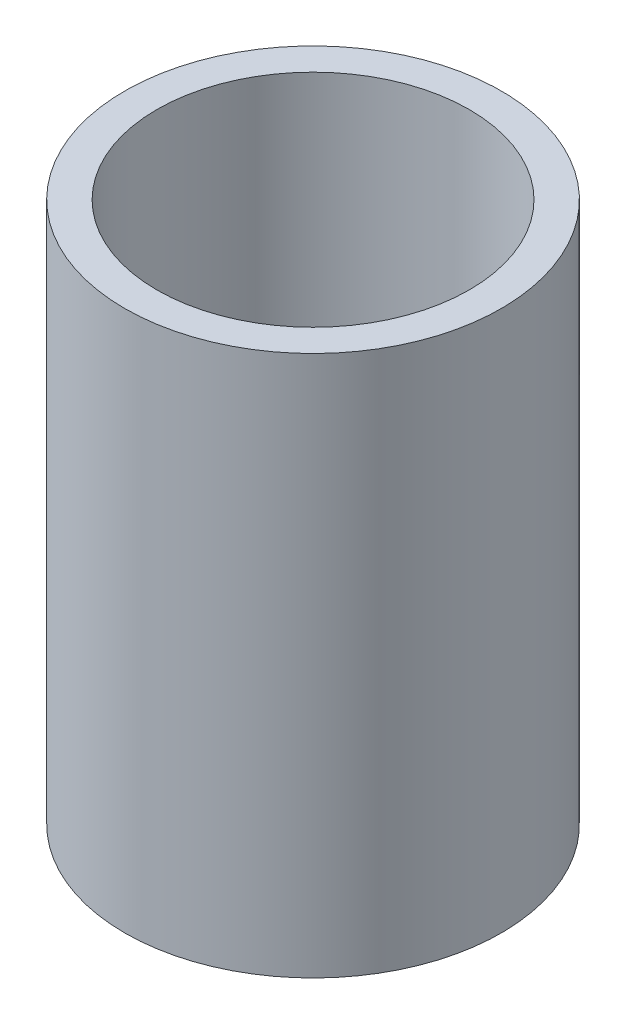
ISO-10303-21;
HEADER;
FILE_DESCRIPTION(('STEP AP214'),'2;1');
FILE_NAME('part.step','',(''),(''),'','','');
FILE_SCHEMA(('AUTOMOTIVE_DESIGN { 1 0 10303 214 1 1 1 1 }'));
ENDSEC;
DATA;
#1=APPLICATION_CONTEXT('core data for automotive mechanical design processes');
#2=APPLICATION_PROTOCOL_DEFINITION('international standard','automotive_design',2000,#1);
#3=PRODUCT_CONTEXT('',#1,'mechanical');
#4=PRODUCT('Part','Part','',(#3));
#5=PRODUCT_RELATED_PRODUCT_CATEGORY('part','',(#4));
#6=PRODUCT_DEFINITION_FORMATION('','',#4);
#7=PRODUCT_DEFINITION_CONTEXT('part definition',#1,'design');
#8=PRODUCT_DEFINITION('design','',#6,#7);
#9=PRODUCT_DEFINITION_SHAPE('','',#8);
#10=(LENGTH_UNIT() NAMED_UNIT(*) SI_UNIT(.MILLI.,.METRE.));
#11=(NAMED_UNIT(*) PLANE_ANGLE_UNIT() SI_UNIT($,.RADIAN.));
#12=(NAMED_UNIT(*) SI_UNIT($,.STERADIAN.) SOLID_ANGLE_UNIT());
#13=UNCERTAINTY_MEASURE_WITH_UNIT(LENGTH_MEASURE(1.E-05),#10,'distance_accuracy_value','');
#14=(GEOMETRIC_REPRESENTATION_CONTEXT(3) GLOBAL_UNCERTAINTY_ASSIGNED_CONTEXT((#13)) GLOBAL_UNIT_ASSIGNED_CONTEXT((#10,
#11,#12)) REPRESENTATION_CONTEXT('',''));
#15=CARTESIAN_POINT('',(0.,0.,0.));
#16=DIRECTION('',(0.,0.,1.));
#17=DIRECTION('',(1.,0.,0.));
#18=AXIS2_PLACEMENT_3D('',#15,#16,#17);
#19=CARTESIAN_POINT('',(0.,71.7825005579207,0.));
#20=DIRECTION('',(0.,-1.,0.));
#21=DIRECTION('',(0.,0.,-1.));
#22=AXIS2_PLACEMENT_3D('',#19,#20,#21);
#23=CYLINDRICAL_SURFACE('',#22,25.);
#24=CARTESIAN_POINT('',(0.,71.7825005579207,0.));
#25=DIRECTION('',(0.,1.,0.));
#26=DIRECTION('',(0.,0.,1.));
#27=AXIS2_PLACEMENT_3D('',#24,#25,#26);
#28=CIRCLE('',#27,25.);
#29=CARTESIAN_POINT('',(0.,71.7825005579207,25.));
#30=VERTEX_POINT('',#29);
#31=EDGE_CURVE('E10',#30,#30,#28,.T.);
#32=ORIENTED_EDGE('',*,*,#31,.F.);
#33=EDGE_LOOP('',(#32));
#34=FACE_BOUND('',#33,.T.);
#35=CARTESIAN_POINT('',(0.,0.,0.));
#36=DIRECTION('',(0.,1.,0.));
#37=DIRECTION('',(0.,0.,1.));
#38=AXIS2_PLACEMENT_3D('',#35,#36,#37);
#39=CIRCLE('',#38,25.);
#40=CARTESIAN_POINT('',(0.,0.,25.));
#41=VERTEX_POINT('',#40);
#42=EDGE_CURVE('E37',#41,#41,#39,.T.);
#43=ORIENTED_EDGE('',*,*,#42,.T.);
#44=EDGE_LOOP('',(#43));
#45=FACE_BOUND('',#44,.T.);
#46=ADVANCED_FACE('F40',(#34,#45),#23,.T.);
#47=CARTESIAN_POINT('',(0.,71.7825005579207,0.));
#48=DIRECTION('',(0.,1.,0.));
#49=DIRECTION('',(0.,0.,1.));
#50=AXIS2_PLACEMENT_3D('',#47,#48,#49);
#51=PLANE('',#50);
#52=CARTESIAN_POINT('',(0.,71.7825005579207,0.));
#53=DIRECTION('',(0.,1.,0.));
#54=DIRECTION('',(0.,0.,1.));
#55=AXIS2_PLACEMENT_3D('',#52,#53,#54);
#56=CIRCLE('',#55,20.7378622487795);
#57=CARTESIAN_POINT('',(0.,71.7825005579207,20.7378622487795));
#58=VERTEX_POINT('',#57);
#59=EDGE_CURVE('E50',#58,#58,#56,.T.);
#60=ORIENTED_EDGE('',*,*,#59,.F.);
#61=EDGE_LOOP('',(#60));
#62=FACE_BOUND('',#61,.T.);
#63=ORIENTED_EDGE('',*,*,#31,.T.);
#64=EDGE_LOOP('',(#63));
#65=FACE_BOUND('',#64,.T.);
#66=ADVANCED_FACE('F59',(#62,#65),#51,.T.);
#67=CARTESIAN_POINT('',(0.,0.,0.));
#68=DIRECTION('',(0.,1.,0.));
#69=DIRECTION('',(0.,0.,1.));
#70=AXIS2_PLACEMENT_3D('',#67,#68,#69);
#71=PLANE('',#70);
#72=CARTESIAN_POINT('',(0.,0.,0.));
#73=DIRECTION('',(0.,1.,0.));
#74=DIRECTION('',(0.,0.,1.));
#75=AXIS2_PLACEMENT_3D('',#72,#73,#74);
#76=CIRCLE('',#75,20.7378622487795);
#77=CARTESIAN_POINT('',(0.,0.,20.7378622487795));
#78=VERTEX_POINT('',#77);
#79=EDGE_CURVE('E47',#78,#78,#76,.T.);
#80=ORIENTED_EDGE('',*,*,#79,.T.);
#81=EDGE_LOOP('',(#80));
#82=FACE_BOUND('',#81,.T.);
#83=ORIENTED_EDGE('',*,*,#42,.F.);
#84=EDGE_LOOP('',(#83));
#85=FACE_BOUND('',#84,.T.);
#86=ADVANCED_FACE('F58',(#82,#85),#71,.F.);
#87=CARTESIAN_POINT('',(0.,71.7825005579207,0.));
#88=DIRECTION('',(0.,-1.,0.));
#89=DIRECTION('',(0.,0.,-1.));
#90=AXIS2_PLACEMENT_3D('',#87,#88,#89);
#91=CYLINDRICAL_SURFACE('',#90,20.7378622487795);
#92=ORIENTED_EDGE('',*,*,#59,.T.);
#93=EDGE_LOOP('',(#92));
#94=FACE_BOUND('',#93,.T.);
#95=ORIENTED_EDGE('',*,*,#79,.F.);
#96=EDGE_LOOP('',(#95));
#97=FACE_BOUND('',#96,.T.);
#98=ADVANCED_FACE('F54',(#94,#97),#91,.F.);
#99=CLOSED_SHELL('',(#46,#66,#86,#98));
#100=MANIFOLD_SOLID_BREP('B2',#99);
#101=ADVANCED_BREP_SHAPE_REPRESENTATION('',(#18,#100),#14);
#102=SHAPE_DEFINITION_REPRESENTATION(#9,#101);
ENDSEC;
END-ISO-10303-21;
